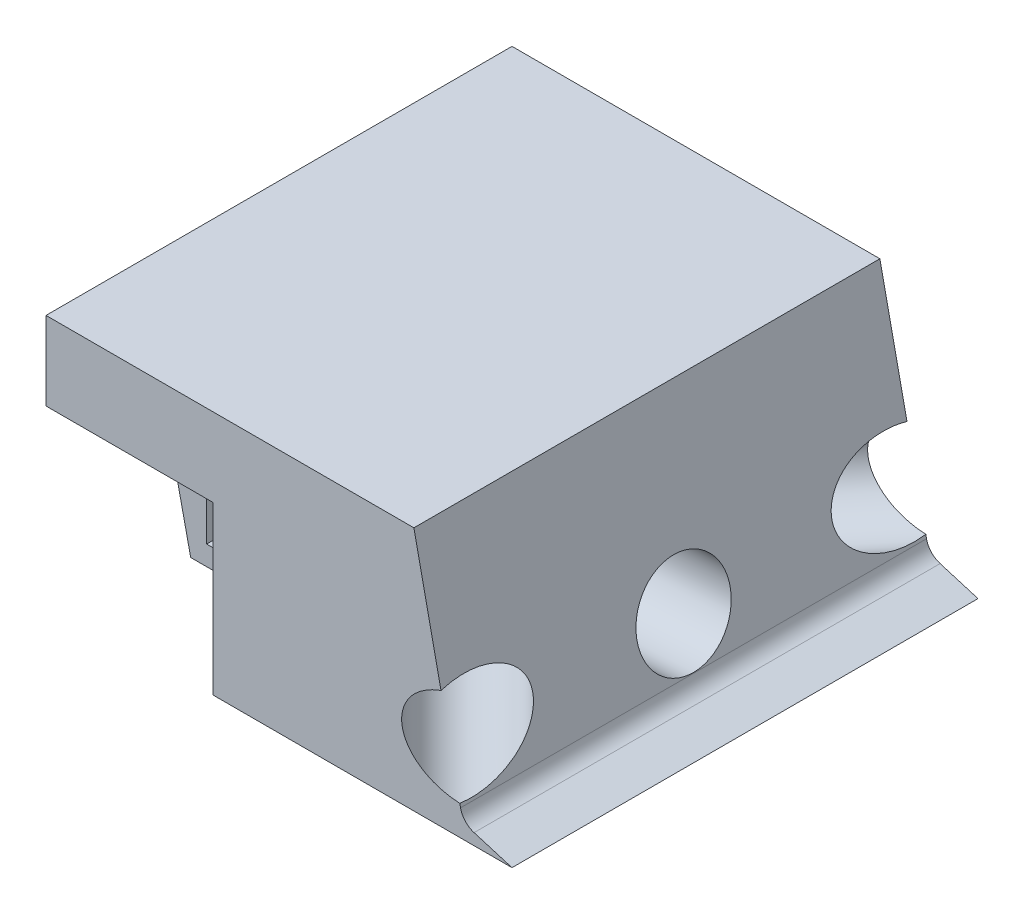
ISO-10303-21;
HEADER;
FILE_DESCRIPTION(('STEP AP214'),'2;1');
FILE_NAME('part.step','',(''),(''),'','','');
FILE_SCHEMA(('AUTOMOTIVE_DESIGN { 1 0 10303 214 1 1 1 1 }'));
ENDSEC;
DATA;
#1=APPLICATION_CONTEXT('core data for automotive mechanical design processes');
#2=APPLICATION_PROTOCOL_DEFINITION('international standard','automotive_design',2000,#1);
#3=PRODUCT_CONTEXT('',#1,'mechanical');
#4=PRODUCT('Part','Part','',(#3));
#5=PRODUCT_RELATED_PRODUCT_CATEGORY('part','',(#4));
#6=PRODUCT_DEFINITION_FORMATION('','',#4);
#7=PRODUCT_DEFINITION_CONTEXT('part definition',#1,'design');
#8=PRODUCT_DEFINITION('design','',#6,#7);
#9=PRODUCT_DEFINITION_SHAPE('','',#8);
#10=(LENGTH_UNIT() NAMED_UNIT(*) SI_UNIT(.MILLI.,.METRE.));
#11=(NAMED_UNIT(*) PLANE_ANGLE_UNIT() SI_UNIT($,.RADIAN.));
#12=(NAMED_UNIT(*) SI_UNIT($,.STERADIAN.) SOLID_ANGLE_UNIT());
#13=UNCERTAINTY_MEASURE_WITH_UNIT(LENGTH_MEASURE(1.E-05),#10,'distance_accuracy_value','');
#14=(GEOMETRIC_REPRESENTATION_CONTEXT(3) GLOBAL_UNCERTAINTY_ASSIGNED_CONTEXT((#13)) GLOBAL_UNIT_ASSIGNED_CONTEXT((#10,
#11,#12)) REPRESENTATION_CONTEXT('',''));
#15=CARTESIAN_POINT('',(0.,0.,0.));
#16=DIRECTION('',(0.,0.,1.));
#17=DIRECTION('',(1.,0.,0.));
#18=AXIS2_PLACEMENT_3D('',#15,#16,#17);
#19=CARTESIAN_POINT('',(29.0534494855228,3.,-54.5438018836308));
#20=DIRECTION('',(-0.978105928984835,-0.208107644464859,0.));
#21=DIRECTION('',(0.208107644464859,-0.978105928984836,0.));
#22=AXIS2_PLACEMENT_3D('',#19,#20,#21);
#23=PLANE('',#22);
#24=CARTESIAN_POINT('',(26.5329230763294,14.8464741232089,-2.04380188363075));
#25=DIRECTION('',(-0.978105928984835,-0.208107644464859,0.));
#26=DIRECTION('',(-0.208107644464859,0.978105928984836,0.));
#27=AXIS2_PLACEMENT_3D('',#24,#25,#26);
#28=ELLIPSE('',#27,9.61631485144088,9.5);
#29=CARTESIAN_POINT('',(24.5316944441636,24.2522486943882,-2.04380188363075));
#30=VERTEX_POINT('',#29);
#31=EDGE_CURVE('E230',#30,#30,#28,.F.);
#32=ORIENTED_EDGE('',*,*,#31,.F.);
#33=EDGE_LOOP('',(#32));
#34=FACE_BOUND('',#33,.T.);
#35=DIRECTION('',(0.208107644464859,-0.978105928984835,0.));
#36=VECTOR('',#35,1.);
#37=CARTESIAN_POINT('',(29.0534494855228,3.,45.4561981163693));
#38=LINE('',#37,#36);
#39=CARTESIAN_POINT('',(28.4070974389529,6.03785461887886,45.4561981163693));
#40=VERTEX_POINT('',#39);
#41=CARTESIAN_POINT('',(28.5602756421312,5.31791706394046,45.4561981163693));
#42=VERTEX_POINT('',#41);
#43=EDGE_CURVE('E233',#40,#42,#38,.T.);
#44=ORIENTED_EDGE('',*,*,#43,.T.);
#45=DIRECTION('',(0.,0.,1.));
#46=VECTOR('',#45,1.);
#47=CARTESIAN_POINT('',(28.5602756421312,5.31791706394046,-49.5438018836307));
#48=LINE('',#47,#46);
#49=CARTESIAN_POINT('',(28.5602756421313,5.31791706394044,-49.5438018836307));
#50=VERTEX_POINT('',#49);
#51=EDGE_CURVE('E332',#42,#50,#48,.F.);
#52=ORIENTED_EDGE('',*,*,#51,.T.);
#53=DIRECTION('',(0.208107644464859,-0.978105928984836,0.));
#54=VECTOR('',#53,1.);
#55=CARTESIAN_POINT('',(15.8052901091694,65.266349068861,-49.5438018836307));
#56=LINE('',#55,#54);
#57=CARTESIAN_POINT('',(28.4070974389529,6.03785461887894,-49.5438018836307));
#58=VERTEX_POINT('',#57);
#59=EDGE_CURVE('E242',#58,#50,#56,.T.);
#60=ORIENTED_EDGE('',*,*,#59,.F.);
#61=CARTESIAN_POINT('',(26.4460534707917,15.2547612692362,-45.9972058727721));
#62=DIRECTION('',(-0.978105928984835,-0.208107644464859,0.));
#63=DIRECTION('',(-0.0258354710819737,0.121426714085276,0.992264118841564));
#64=AXIS2_PLACEMENT_3D('',#61,#62,#63);
#65=ELLIPSE('',#64,13.5164397497986,9.49999999999975);
#66=CARTESIAN_POINT('',(24.5777437795974,24.0358168178494,-49.5438018836307));
#67=VERTEX_POINT('',#66);
#68=EDGE_CURVE('E223',#67,#58,#65,.F.);
#69=ORIENTED_EDGE('',*,*,#68,.F.);
#70=CARTESIAN_POINT('',(19.0534494855228,50.,-49.5438018836307));
#71=VERTEX_POINT('',#70);
#72=EDGE_CURVE('E243',#71,#67,#56,.T.);
#73=ORIENTED_EDGE('',*,*,#72,.F.);
#74=DIRECTION('',(0.,0.,1.));
#75=VECTOR('',#74,1.);
#76=CARTESIAN_POINT('',(19.0534494855228,50.,-54.5438018836308));
#77=LINE('',#76,#75);
#78=CARTESIAN_POINT('',(19.0534494855228,50.,45.4561981163693));
#79=VERTEX_POINT('',#78);
#80=EDGE_CURVE('E240',#71,#79,#77,.T.);
#81=ORIENTED_EDGE('',*,*,#80,.T.);
#82=CARTESIAN_POINT('',(24.5777437795974,24.0358168178494,45.4561981163693));
#83=VERTEX_POINT('',#82);
#84=EDGE_CURVE('E234',#79,#83,#38,.T.);
#85=ORIENTED_EDGE('',*,*,#84,.T.);
#86=CARTESIAN_POINT('',(26.4460534707917,15.2547612692361,41.9096021055104));
#87=DIRECTION('',(-0.978105928984835,-0.208107644464859,0.));
#88=DIRECTION('',(-0.0258354710819744,0.12142671408528,-0.992264118841563));
#89=AXIS2_PLACEMENT_3D('',#86,#87,#88);
#90=ELLIPSE('',#89,13.5164397497986,9.49999999999983);
#91=EDGE_CURVE('E228',#40,#83,#90,.F.);
#92=ORIENTED_EDGE('',*,*,#91,.F.);
#93=EDGE_LOOP('',(#44,#52,#60,#69,#73,#81,#85,#92));
#94=FACE_BOUND('',#93,.T.);
#95=ADVANCED_FACE('F33',(#34,#94),#23,.F.);
#96=CARTESIAN_POINT('',(-55.9465505144772,50.,-49.5438018836307));
#97=DIRECTION('',(0.,0.,1.));
#98=DIRECTION('',(1.,0.,0.));
#99=AXIS2_PLACEMENT_3D('',#96,#97,#98);
#100=PLANE('',#99);
#101=DIRECTION('',(-1.,0.,0.));
#102=VECTOR('',#101,1.);
#103=CARTESIAN_POINT('',(-55.9465505144772,0.,-49.5438018836307));
#104=LINE('',#103,#102);
#105=CARTESIAN_POINT('',(39.0534494855228,0.,-49.5438018836307));
#106=VERTEX_POINT('',#105);
#107=CARTESIAN_POINT('',(-21.9465505144772,0.,-49.5438018836307));
#108=VERTEX_POINT('',#107);
#109=EDGE_CURVE('E302',#106,#108,#104,.T.);
#110=ORIENTED_EDGE('',*,*,#109,.T.);
#111=DIRECTION('',(0.,-1.,0.));
#112=VECTOR('',#111,1.);
#113=CARTESIAN_POINT('',(-21.9465505144772,0.,-49.5438018836307));
#114=LINE('',#113,#112);
#115=CARTESIAN_POINT('',(-21.9465505144772,34.,-49.5438018836307));
#116=VERTEX_POINT('',#115);
#117=EDGE_CURVE('E376',#116,#108,#114,.T.);
#118=ORIENTED_EDGE('',*,*,#117,.F.);
#119=DIRECTION('',(1.,0.,0.));
#120=VECTOR('',#119,1.);
#121=CARTESIAN_POINT('',(-55.9465505144772,34.,-49.5438018836307));
#122=LINE('',#121,#120);
#123=CARTESIAN_POINT('',(-55.9465505144772,34.,-49.5438018836307));
#124=VERTEX_POINT('',#123);
#125=EDGE_CURVE('E357',#124,#116,#122,.T.);
#126=ORIENTED_EDGE('',*,*,#125,.F.);
#127=DIRECTION('',(0.,-1.,0.));
#128=VECTOR('',#127,1.);
#129=CARTESIAN_POINT('',(-55.9465505144772,50.,-49.5438018836307));
#130=LINE('',#129,#128);
#131=CARTESIAN_POINT('',(-55.9465505144772,50.,-49.5438018836307));
#132=VERTEX_POINT('',#131);
#133=EDGE_CURVE('E307',#132,#124,#130,.T.);
#134=ORIENTED_EDGE('',*,*,#133,.F.);
#135=DIRECTION('',(-1.,0.,0.));
#136=VECTOR('',#135,1.);
#137=CARTESIAN_POINT('',(-55.9465505144772,50.,-49.5438018836307));
#138=LINE('',#137,#136);
#139=EDGE_CURVE('E305',#71,#132,#138,.T.);
#140=ORIENTED_EDGE('',*,*,#139,.F.);
#141=ORIENTED_EDGE('',*,*,#72,.T.);
#142=CARTESIAN_POINT('',(29.9926494816504,15.555699919965,-49.5438018836307));
#143=DIRECTION('',(0.,0.,1.));
#144=DIRECTION('',(-0.996419324090102,-0.0845489833163317,0.));
#145=AXIS2_PLACEMENT_3D('',#142,#143,#144);
#146=ELLIPSE('',#145,13.4591901688025,9.49999999999975);
#147=EDGE_CURVE('E327',#58,#67,#146,.F.);
#148=ORIENTED_EDGE('',*,*,#147,.F.);
#149=ORIENTED_EDGE('',*,*,#59,.T.);
#150=CARTESIAN_POINT('',(32.4726993580706,6.1503476417999,-49.5438018836307));
#151=DIRECTION('',(0.,0.,1.));
#152=DIRECTION('',(1.,0.,0.));
#153=AXIS2_PLACEMENT_3D('',#150,#151,#152);
#154=CIRCLE('',#153,4.);
#155=CARTESIAN_POINT('',(31.3233078158052,2.31904250091529,-49.5438018836307));
#156=VERTEX_POINT('',#155);
#157=EDGE_CURVE('E336',#50,#156,#154,.T.);
#158=ORIENTED_EDGE('',*,*,#157,.T.);
#159=DIRECTION('',(0.957826285221151,-0.287347885566345,0.));
#160=VECTOR('',#159,1.);
#161=CARTESIAN_POINT('',(-61.8639817071377,30.2752293577982,-49.5438018836307));
#162=LINE('',#161,#160);
#163=EDGE_CURVE('E246',#156,#106,#162,.T.);
#164=ORIENTED_EDGE('',*,*,#163,.T.);
#165=EDGE_LOOP('',(#110,#118,#126,#134,#140,#141,#148,#149,#158,#164));
#166=FACE_BOUND('',#165,.T.);
#167=ADVANCED_FACE('F396',(#166),#100,.F.);
#168=CARTESIAN_POINT('',(-55.9465505144772,50.,45.4561981163693));
#169=DIRECTION('',(0.,0.,-1.));
#170=DIRECTION('',(-1.,0.,0.));
#171=AXIS2_PLACEMENT_3D('',#168,#169,#170);
#172=PLANE('',#171);
#173=DIRECTION('',(0.,-1.,0.));
#174=VECTOR('',#173,1.);
#175=CARTESIAN_POINT('',(-55.9465505144772,50.,45.4561981163693));
#176=LINE('',#175,#174);
#177=CARTESIAN_POINT('',(-55.9465505144772,50.,45.4561981163693));
#178=VERTEX_POINT('',#177);
#179=CARTESIAN_POINT('',(-55.9465505144772,34.,45.4561981163693));
#180=VERTEX_POINT('',#179);
#181=EDGE_CURVE('E316',#178,#180,#176,.T.);
#182=ORIENTED_EDGE('',*,*,#181,.T.);
#183=DIRECTION('',(-1.,0.,0.));
#184=VECTOR('',#183,1.);
#185=CARTESIAN_POINT('',(-55.9465505144772,34.,45.4561981163693));
#186=LINE('',#185,#184);
#187=CARTESIAN_POINT('',(-21.9465505144772,34.,45.4561981163693));
#188=VERTEX_POINT('',#187);
#189=EDGE_CURVE('E207',#188,#180,#186,.T.);
#190=ORIENTED_EDGE('',*,*,#189,.F.);
#191=DIRECTION('',(0.,1.,0.));
#192=VECTOR('',#191,1.);
#193=CARTESIAN_POINT('',(-21.9465505144772,0.,45.4561981163693));
#194=LINE('',#193,#192);
#195=CARTESIAN_POINT('',(-21.9465505144772,0.,45.4561981163693));
#196=VERTEX_POINT('',#195);
#197=EDGE_CURVE('E210',#196,#188,#194,.T.);
#198=ORIENTED_EDGE('',*,*,#197,.F.);
#199=DIRECTION('',(1.,0.,0.));
#200=VECTOR('',#199,1.);
#201=CARTESIAN_POINT('',(-55.9465505144772,0.,45.4561981163693));
#202=LINE('',#201,#200);
#203=CARTESIAN_POINT('',(39.0534494855228,0.,45.4561981163693));
#204=VERTEX_POINT('',#203);
#205=EDGE_CURVE('E296',#196,#204,#202,.T.);
#206=ORIENTED_EDGE('',*,*,#205,.T.);
#207=DIRECTION('',(0.957826285221151,-0.287347885566345,0.));
#208=VECTOR('',#207,1.);
#209=CARTESIAN_POINT('',(39.0534494855228,0.,45.4561981163693));
#210=LINE('',#209,#208);
#211=CARTESIAN_POINT('',(31.3233078158052,2.31904250091529,45.4561981163693));
#212=VERTEX_POINT('',#211);
#213=EDGE_CURVE('E237',#212,#204,#210,.T.);
#214=ORIENTED_EDGE('',*,*,#213,.F.);
#215=CARTESIAN_POINT('',(32.4726993580706,6.1503476417999,45.4561981163693));
#216=DIRECTION('',(0.,0.,-1.));
#217=DIRECTION('',(-1.,0.,0.));
#218=AXIS2_PLACEMENT_3D('',#215,#216,#217);
#219=CIRCLE('',#218,4.);
#220=EDGE_CURVE('E334',#212,#42,#219,.T.);
#221=ORIENTED_EDGE('',*,*,#220,.T.);
#222=ORIENTED_EDGE('',*,*,#43,.F.);
#223=CARTESIAN_POINT('',(29.9926494816506,15.555699919965,45.4561981163693));
#224=DIRECTION('',(0.,0.,-1.));
#225=DIRECTION('',(-0.996419324090102,-0.0845489833163307,0.));
#226=AXIS2_PLACEMENT_3D('',#223,#224,#225);
#227=ELLIPSE('',#226,13.4591901688027,9.49999999999983);
#228=EDGE_CURVE('E325',#83,#40,#227,.F.);
#229=ORIENTED_EDGE('',*,*,#228,.F.);
#230=ORIENTED_EDGE('',*,*,#84,.F.);
#231=DIRECTION('',(1.,0.,0.));
#232=VECTOR('',#231,1.);
#233=CARTESIAN_POINT('',(-55.9465505144772,50.,45.4561981163693));
#234=LINE('',#233,#232);
#235=EDGE_CURVE('E301',#178,#79,#234,.T.);
#236=ORIENTED_EDGE('',*,*,#235,.F.);
#237=EDGE_LOOP('',(#182,#190,#198,#206,#214,#221,#222,#229,#230,#236));
#238=FACE_BOUND('',#237,.T.);
#239=ADVANCED_FACE('F422',(#238),#172,.F.);
#240=CARTESIAN_POINT('',(-6.71686597218381,13.0509855145892,-2.04380188363075));
#241=DIRECTION('',(0.998545180917308,0.0539214397695347,0.));
#242=DIRECTION('',(-0.0539214397695347,0.998545180917309,0.));
#243=AXIS2_PLACEMENT_3D('',#240,#241,#242);
#244=CYLINDRICAL_SURFACE('',#243,9.5);
#245=CARTESIAN_POINT('',(2.07595286425523,13.5257977317569,-2.04380188363075));
#246=DIRECTION('',(0.705837415242126,0.0598922907279467,0.705837415242118));
#247=DIRECTION('',(0.706320591921478,0.0163066443508853,-0.707704256577355));
#248=AXIS2_PLACEMENT_3D('',#245,#246,#247);
#249=ELLIPSE('',#248,13.4173205237938,9.5);
#250=CARTESIAN_POINT('',(-2.73529182406759,5.50305391920782,3.44819519112124));
#251=VERTEX_POINT('',#250);
#252=CARTESIAN_POINT('',(-6.54250412568018,9.82206243118863,6.88892746791498));
#253=VERTEX_POINT('',#252);
#254=EDGE_CURVE('E643',#251,#253,#249,.F.);
#255=ORIENTED_EDGE('',*,*,#254,.F.);
#256=CARTESIAN_POINT('',(-2.7352918240672,5.50305391920813,3.44819519112081));
#257=CARTESIAN_POINT('',(-2.5284890396485,5.58685697103673,3.5505474548381));
#258=CARTESIAN_POINT('',(-2.3222355963858,5.67306030095207,3.65206497166396));
#259=CARTESIAN_POINT('',(-1.91110718577176,5.85059238639249,3.85347303838734));
#260=CARTESIAN_POINT('',(-1.70623240708124,5.94192182803639,3.95336336816974));
#261=CARTESIAN_POINT('',(-1.29763031305163,6.13026980249333,4.15180725024607));
#262=CARTESIAN_POINT('',(-1.09390776310995,6.22730342723031,4.25035632084846));
#263=CARTESIAN_POINT('',(-0.688557696195556,6.42721184050974,4.44581016289113));
#264=CARTESIAN_POINT('',(-0.486930093797941,6.53008638976437,4.54271500148048));
#265=CARTESIAN_POINT('',(-0.0847881839953783,6.74287105630762,4.73549621581496));
#266=CARTESIAN_POINT('',(0.115708565043817,6.85282521869078,4.83136071335836));
#267=CARTESIAN_POINT('',(0.513627162757627,7.07965853107784,5.02125567522945));
#268=CARTESIAN_POINT('',(0.711049141472897,7.19653738720717,5.11528621716293));
#269=CARTESIAN_POINT('',(1.10197559395353,7.43774076208653,5.301251481034));
#270=CARTESIAN_POINT('',(1.29548399963161,7.56205725451272,5.39318831952808));
#271=CARTESIAN_POINT('',(1.67796518608724,7.8189913108621,5.57481606934673));
#272=CARTESIAN_POINT('',(1.86693869036715,7.95160753829248,5.66450733903164));
#273=CARTESIAN_POINT('',(2.20745427281438,8.20256786234128,5.82618031272111));
#274=CARTESIAN_POINT('',(2.35986663423278,8.31946927462305,5.89856544179133));
#275=CARTESIAN_POINT('',(2.66012156386082,8.56021596723413,6.04130759747589));
#276=CARTESIAN_POINT('',(2.80796392173639,8.68406156643315,6.11166453073266));
#277=CARTESIAN_POINT('',(3.09835826000453,8.93960229109413,6.25012111359561));
#278=CARTESIAN_POINT('',(3.2409005475566,9.07131075085102,6.318216605284));
#279=CARTESIAN_POINT('',(3.51915176008551,9.34313632387322,6.45155056223067));
#280=CARTESIAN_POINT('',(3.65486093357087,9.48325313093473,6.516789131379));
#281=CARTESIAN_POINT('',(3.91977000202753,9.77491405274352,6.64473796275492));
#282=CARTESIAN_POINT('',(4.04884565410897,9.92659533462317,6.70739728705121));
#283=CARTESIAN_POINT('',(4.29597800501789,10.2402898625221,6.82824748125247));
#284=CARTESIAN_POINT('',(4.41403093095531,10.4023066144884,6.88643681995864));
#285=CARTESIAN_POINT('',(4.7463903980432,10.9039127852696,7.05214090146896));
#286=CARTESIAN_POINT('',(4.94067101181784,11.2609089942035,7.15164171155111));
#287=CARTESIAN_POINT('',(5.17078091057172,11.8421317495828,7.27690912252399));
#288=CARTESIAN_POINT('',(5.23830109718238,12.0510792622815,7.3154639919302));
#289=CARTESIAN_POINT('',(5.3416578257548,12.4786785073256,7.37971805671404));
#290=CARTESIAN_POINT('',(5.37752719413414,12.6973199378516,7.40543055941598));
#291=CARTESIAN_POINT('',(5.41279066674086,13.1404562507173,7.44198829889074));
#292=CARTESIAN_POINT('',(5.41193054665659,13.3649811764726,7.45272938262297));
#293=CARTESIAN_POINT('',(5.37165861093977,13.8107714853821,7.45823060667445));
#294=CARTESIAN_POINT('',(5.33224104227713,14.0320363771165,7.45298836192672));
#295=CARTESIAN_POINT('',(5.22262018502946,14.4469965972219,7.42868963074717));
#296=CARTESIAN_POINT('',(5.15510100921995,14.6414877960957,7.41075957375059));
#297=CARTESIAN_POINT('',(4.99485974943007,15.018267243802,7.36422678667008));
#298=CARTESIAN_POINT('',(4.90212785115159,15.2005507061451,7.33561989890603));
#299=CARTESIAN_POINT('',(4.63169114317075,15.6622771543008,7.24907779602607));
#300=CARTESIAN_POINT('',(4.4372549121772,15.9305980440984,7.18401901245872));
#301=CARTESIAN_POINT('',(4.11936110556804,16.3069410784372,7.07519806911159));
#302=CARTESIAN_POINT('',(4.00878729010553,16.4282384797407,7.03696863458578));
#303=CARTESIAN_POINT('',(3.78040187587814,16.6627627907887,6.95742701935154));
#304=CARTESIAN_POINT('',(3.6625916221266,16.7759911918916,6.91611541121222));
#305=CARTESIAN_POINT('',(3.31917347868404,17.087419109953,6.79508959636809));
#306=CARTESIAN_POINT('',(3.08651224274498,17.2766689869357,6.71239387906013));
#307=CARTESIAN_POINT('',(2.607150474039,17.6336336212181,6.54122849014518));
#308=CARTESIAN_POINT('',(2.36043720803621,17.801328383506,6.4527535707085));
#309=CARTESIAN_POINT('',(1.85561772598296,18.119053854895,6.27138163992721));
#310=CARTESIAN_POINT('',(1.59745980077808,18.2689900672961,6.17846436837508));
#311=CARTESIAN_POINT('',(1.07360789387455,18.5527683466452,5.98991773858171));
#312=CARTESIAN_POINT('',(0.80791664029042,18.6866161501171,5.8942893621396));
#313=CARTESIAN_POINT('',(0.333484370093445,18.9106789829904,5.72377565958062));
#314=CARTESIAN_POINT('',(0.125956301414573,19.0037776166849,5.6492695208411));
#315=CARTESIAN_POINT('',(-0.292009575162518,19.1825415844987,5.4994889075905));
#316=CARTESIAN_POINT('',(-0.502447589724232,19.2682063874935,5.42421437860899));
#317=CARTESIAN_POINT('',(-1.13771541662509,19.5151487420168,5.19755551081745));
#318=CARTESIAN_POINT('',(-1.5662620281544,19.6662643995045,5.04542132505742));
#319=CARTESIAN_POINT('',(-2.20957714194902,19.8739760297287,4.81889076944873));
#320=CARTESIAN_POINT('',(-2.4215960450027,19.9393886465901,4.74452621582118));
#321=CARTESIAN_POINT('',(-2.84722869456327,20.0650462834311,4.59594933018217));
#322=CARTESIAN_POINT('',(-3.06084247655929,20.1252911880445,4.52173700160513));
#323=CARTESIAN_POINT('',(-3.48911661576973,20.2408267523935,4.37379168444273));
#324=CARTESIAN_POINT('',(-3.70377447327178,20.2961259345674,4.30005808257861));
#325=CARTESIAN_POINT('',(-4.1343860358446,20.4021413520917,4.15314214013571));
#326=CARTESIAN_POINT('',(-4.35033962957167,20.4528579753771,4.07995975337569));
#327=CARTESIAN_POINT('',(-4.56689805842534,20.5014142819928,4.00714834717474));
#328=B_SPLINE_CURVE_WITH_KNOTS('',3,(#256,#257,#258,#259,#260,#261,#262,#263,#264,#265,#266,
#267,#268,#269,#270,#271,#272,#273,#274,#275,#276,#277,#278,#279,#280,#281,#282,#283,#284,#285,
#286,#287,#288,#289,#290,#291,#292,#293,#294,#295,#296,#297,#298,#299,#300,#301,#302,#303,#304,
#305,#306,#307,#308,#309,#310,#311,#312,#313,#314,#315,#316,#317,#318,#319,#320,#321,#322,#323,
#324,#325,#326,#327),.UNSPECIFIED.,.F.,.F.,(4,2,2,2,2,2,2,2,2,2,2,2,2,2,2,2,2,2,2,2,2,2,2,2,2,2,
2,2,2,2,2,2,2,2,2,4),(0.,0.736474954782578,1.47304872129461,2.21166761566259,2.95025627249742,
3.69399354147617,4.43769926983485,5.18061641913616,5.92341424398032,6.53906498553613,
7.15474402030964,7.77149857583298,8.3882306848381,9.01398354687215,9.63994981417915,
10.8838580104374,11.550440569303,12.2163309715297,12.8868310973119,13.5574312814754,
14.1749447147176,14.7926988660801,15.7995648840619,16.3049281886689,16.8101978456077,
17.7419560001177,18.6745723310167,19.611947329555,20.5489870975344,21.2668831880064,
21.9848305278057,23.4215482412065,24.1235416579923,24.8255507423223,25.5263258328982,
26.2270415439241),.UNSPECIFIED.);
#329=CARTESIAN_POINT('',(-4.5668980584258,20.5014142819928,4.00714834717488));
#330=VERTEX_POINT('',#329);
#331=EDGE_CURVE('E251',#251,#330,#328,.T.);
#332=ORIENTED_EDGE('',*,*,#331,.T.);
#333=CARTESIAN_POINT('',(-6.92054724762188,16.8228609856645,6.67293313406577));
#334=VERTEX_POINT('',#333);
#335=EDGE_CURVE('E259',#334,#330,#249,.F.);
#336=ORIENTED_EDGE('',*,*,#335,.F.);
#337=CARTESIAN_POINT('',(-6.71686597218381,13.0509855145892,-2.04380188363075));
#338=DIRECTION('',(0.998545180917308,0.0539214397695347,0.));
#339=DIRECTION('',(-0.0539214397695347,0.998545180917309,0.));
#340=AXIS2_PLACEMENT_3D('',#337,#338,#339);
#341=CIRCLE('',#340,9.5);
#342=CARTESIAN_POINT('',(-6.92054724762186,16.8228609856642,-10.7605369013274));
#343=VERTEX_POINT('',#342);
#344=EDGE_CURVE('E293',#343,#334,#341,.T.);
#345=ORIENTED_EDGE('',*,*,#344,.F.);
#346=CARTESIAN_POINT('',(2.07595286425553,13.525797731757,-2.04380188363075));
#347=DIRECTION('',(0.705837415242118,0.0598922907279468,-0.705837415242125));
#348=DIRECTION('',(0.706320591921486,0.0163066443508857,0.707704256577347));
#349=AXIS2_PLACEMENT_3D('',#346,#347,#348);
#350=ELLIPSE('',#349,13.4173205237939,9.5);
#351=CARTESIAN_POINT('',(-4.56689805842566,20.5014142819929,-8.09475211443639));
#352=VERTEX_POINT('',#351);
#353=EDGE_CURVE('E292',#352,#343,#350,.F.);
#354=ORIENTED_EDGE('',*,*,#353,.F.);
#355=CARTESIAN_POINT('',(-4.56689805842484,20.5014142819925,-8.0947521144356));
#356=CARTESIAN_POINT('',(-4.33225599602943,20.4488003755294,-8.17364472122514));
#357=CARTESIAN_POINT('',(-4.09831991987234,20.3936533999042,-8.25297274054923));
#358=CARTESIAN_POINT('',(-3.6319723273335,20.2779532455273,-8.41225867708304));
#359=CARTESIAN_POINT('',(-3.39956099855203,20.2173994144437,-8.49221666923444));
#360=CARTESIAN_POINT('',(-2.935850455229,20.0903986941744,-8.65270379654423));
#361=CARTESIAN_POINT('',(-2.70455550191642,20.0239373811584,-8.73323386194536));
#362=CARTESIAN_POINT('',(-2.24388052249788,19.8848391065148,-8.89442045986951));
#363=CARTESIAN_POINT('',(-2.01450042627539,19.8122023721123,-8.97507698763224));
#364=CARTESIAN_POINT('',(-1.55665311912561,19.6598445083659,-9.13671461530698));
#365=CARTESIAN_POINT('',(-1.32819788787797,19.5800865754283,-9.21769505721916));
#366=CARTESIAN_POINT('',(-0.873840453641928,19.4132426691012,-9.37926210189281));
#367=CARTESIAN_POINT('',(-0.647938153388363,19.3261569759698,-9.45984871959191));
#368=CARTESIAN_POINT('',(-0.199351831332736,19.144036344205,-9.6202507628795));
#369=CARTESIAN_POINT('',(0.023335063029552,19.0490090914755,-9.70006685259626));
#370=CARTESIAN_POINT('',(0.465080976334485,18.850102721621,-9.85864143280677));
#371=CARTESIAN_POINT('',(0.684140511012849,18.746224876001,-9.93740007334148));
#372=CARTESIAN_POINT('',(1.0882753148595,18.5434306951372,-10.0827938815438));
#373=CARTESIAN_POINT('',(1.27391125425415,18.4457695180671,-10.1496176838629));
#374=CARTESIAN_POINT('',(1.64121856569114,18.2422888667174,-10.2818141032291));
#375=CARTESIAN_POINT('',(1.8228897567433,18.1364690209913,-10.3471866540291));
#376=CARTESIAN_POINT('',(2.18180318740148,17.9154812272708,-10.4761990874294));
#377=CARTESIAN_POINT('',(2.35903321530376,17.8002905639837,-10.5398342282835));
#378=CARTESIAN_POINT('',(2.70736810734731,17.5597145325413,-10.6646267749547));
#379=CARTESIAN_POINT('',(2.87847325864263,17.4343296432282,-10.7257842969483));
#380=CARTESIAN_POINT('',(3.21560789538356,17.1700108716297,-10.8458280804137));
#381=CARTESIAN_POINT('',(3.3815120071856,17.0308919788594,-10.9046622011023));
#382=CARTESIAN_POINT('',(3.70301721095151,16.7393269509347,-11.0179659926317));
#383=CARTESIAN_POINT('',(3.85861388019386,16.5868751591608,-11.0724337920489));
#384=CARTESIAN_POINT('',(4.15532843354882,16.2681178542739,-11.175255156819));
#385=CARTESIAN_POINT('',(4.29652253014544,16.1018947160832,-11.2236412584394));
#386=CARTESIAN_POINT('',(4.56092453322871,15.7538739756097,-11.312729991647));
#387=CARTESIAN_POINT('',(4.6841501476811,15.5720919909097,-11.3534401995967));
#388=CARTESIAN_POINT('',(4.90699547178048,15.1928383248048,-11.4248090153655));
#389=CARTESIAN_POINT('',(5.00664714506123,14.9953883784836,-11.4554812554512));
#390=CARTESIAN_POINT('',(5.17599854601488,14.5865103891999,-11.504156845132));
#391=CARTESIAN_POINT('',(5.24572689940183,14.3750959296611,-11.5221723132073));
#392=CARTESIAN_POINT('',(5.34995577599859,13.9412413877521,-11.543365030161));
#393=CARTESIAN_POINT('',(5.38420212979633,13.71873356199,-11.5464357958064));
#394=CARTESIAN_POINT('',(5.41393294135975,13.2714775021975,-11.5365326069259));
#395=CARTESIAN_POINT('',(5.4094138866725,13.0467290669929,-11.5235571985806));
#396=CARTESIAN_POINT('',(5.3655597958662,12.6205480738891,-11.4842653281633));
#397=CARTESIAN_POINT('',(5.32906057848457,12.4186964095706,-11.4591085752597));
#398=CARTESIAN_POINT('',(5.22927541660934,12.0235933932393,-11.3979350687655));
#399=CARTESIAN_POINT('',(5.16597845962318,11.830345613103,-11.3619138521912));
#400=CARTESIAN_POINT('',(4.97172264577934,11.3387911087939,-11.2561248609913));
#401=CARTESIAN_POINT('',(4.82309423269255,11.0489905434561,-11.1792291698687));
#402=CARTESIAN_POINT('',(4.5709731233482,10.6363754584025,-11.0521685963663));
#403=CARTESIAN_POINT('',(4.48187362643259,10.5022858197283,-11.0077672229066));
#404=CARTESIAN_POINT('',(4.29553006882358,10.2410530940272,-10.9156780870717));
#405=CARTESIAN_POINT('',(4.19828744896855,10.1139087846493,-10.8679909063485));
#406=CARTESIAN_POINT('',(3.91295820390433,9.76255830121186,-10.7288676210697));
#407=CARTESIAN_POINT('',(3.71691217857024,9.54610723217295,-10.6341976878373));
#408=CARTESIAN_POINT('',(3.30856784086871,9.13237785709488,-10.4381006952109));
#409=CARTESIAN_POINT('',(3.09625481624534,8.93511728218306,-10.3366675300084));
#410=CARTESIAN_POINT('',(2.65870269186332,8.55646590935589,-10.1281800605755));
#411=CARTESIAN_POINT('',(2.43340888811384,8.37515186222596,-10.021102157976));
#412=CARTESIAN_POINT('',(1.97367945489025,8.02718286624318,-9.80277028206226));
#413=CARTESIAN_POINT('',(1.73924105454741,7.86053241113764,-9.69151504337773));
#414=CARTESIAN_POINT('',(1.16336505936575,7.47279453375139,-9.41805676499994));
#415=CARTESIAN_POINT('',(0.818360817173119,7.25825792323411,-9.25408961908723));
#416=CARTESIAN_POINT('',(0.118215035644663,6.8511184717841,-8.92028491578519));
#417=CARTESIAN_POINT('',(-0.236932595157035,6.658529172737,-8.7504438173944));
#418=CARTESIAN_POINT('',(-0.946922814297158,6.29630927652942,-8.40912523956741));
#419=CARTESIAN_POINT('',(-1.30161631569162,6.12628262905609,-8.23775634720461));
#420=CARTESIAN_POINT('',(-1.83709095063916,5.88358396276574,-7.97715602075883));
#421=CARTESIAN_POINT('',(-2.01602683832496,5.8047927816907,-7.88976128493358));
#422=CARTESIAN_POINT('',(-2.37492982051103,5.65107606405432,-7.71372460314205));
#423=CARTESIAN_POINT('',(-2.55489685977932,5.57615032255826,-7.6250827236136));
#424=CARTESIAN_POINT('',(-2.73529182406675,5.50305391920793,-7.53579895838253));
#425=B_SPLINE_CURVE_WITH_KNOTS('',3,(#355,#356,#357,#358,#359,#360,#361,#362,#363,#364,#365,
#366,#367,#368,#369,#370,#371,#372,#373,#374,#375,#376,#377,#378,#379,#380,#381,#382,#383,#384,
#385,#386,#387,#388,#389,#390,#391,#392,#393,#394,#395,#396,#397,#398,#399,#400,#401,#402,#403,
#404,#405,#406,#407,#408,#409,#410,#411,#412,#413,#414,#415,#416,#417,#418,#419,#420,#421,#422,
#423,#424),.UNSPECIFIED.,.F.,.F.,(4,2,2,2,2,2,2,2,2,2,2,2,2,2,2,2,2,2,2,2,2,2,2,2,2,2,2,2,2,2,2,
2,2,2,4),(0.,0.759235565759512,1.51856285664431,2.27979792708037,3.04100499993291,
3.80640315451802,4.57177204890092,5.33640860609208,6.10093549774817,6.76120496214763,
7.42150450496608,8.08345527666092,8.74537497320384,9.41790796150104,10.0907276759899,
10.7597790295933,11.4281665100883,12.0956424697516,12.7624784669635,13.434058883109,
14.1057001504001,14.7232015907741,15.3409570391736,16.338754396032,16.8395483653825,
17.340253911079,18.2597146907051,19.1800170979018,20.1045308137893,21.0293268728913,
22.3427231125527,23.6569254030598,24.9436310287062,25.5860736801143,26.2284822359456),.UNSPECIFIED.);
#426=CARTESIAN_POINT('',(-2.73529182406738,5.50305391920772,-7.53579895838272));
#427=VERTEX_POINT('',#426);
#428=EDGE_CURVE('E283',#352,#427,#425,.T.);
#429=ORIENTED_EDGE('',*,*,#428,.T.);
#430=CARTESIAN_POINT('',(-6.5425041256802,9.82206243118891,-10.9765312351766));
#431=VERTEX_POINT('',#430);
#432=EDGE_CURVE('E289',#431,#427,#350,.F.);
#433=ORIENTED_EDGE('',*,*,#432,.F.);
#434=EDGE_CURVE('E297',#253,#431,#341,.T.);
#435=ORIENTED_EDGE('',*,*,#434,.F.);
#436=EDGE_LOOP('',(#255,#332,#336,#345,#354,#429,#433,#435));
#437=FACE_BOUND('',#436,.T.);
#438=ORIENTED_EDGE('',*,*,#31,.T.);
#439=EDGE_LOOP('',(#438));
#440=FACE_BOUND('',#439,.T.);
#441=ADVANCED_FACE('F261',(#437,#440),#244,.F.);
#442=CARTESIAN_POINT('',(-7.66624825135373,12.3602364848829,-11.8849041506263));
#443=DIRECTION('',(0.705837415242118,0.0598922907279468,-0.705837415242125));
#444=DIRECTION('',(-0.707106781186551,0.,-0.707106781186544));
#445=AXIS2_PLACEMENT_3D('',#442,#443,#444);
#446=CYLINDRICAL_SURFACE('',#445,9.50000000000001);
#447=CARTESIAN_POINT('',(-7.66624825135373,12.3602364848829,-11.8849041506263));
#448=DIRECTION('',(0.705837415242118,0.0598922907279468,-0.705837415242125));
#449=DIRECTION('',(-0.707106781186551,0.,-0.707106781186544));
#450=AXIS2_PLACEMENT_3D('',#447,#448,#449);
#451=CIRCLE('',#450,9.50000000000001);
#452=EDGE_CURVE('E290',#427,#352,#451,.T.);
#453=ORIENTED_EDGE('',*,*,#452,.F.);
#454=ORIENTED_EDGE('',*,*,#428,.F.);
#455=EDGE_LOOP('',(#453,#454));
#456=FACE_BOUND('',#455,.T.);
#457=ORIENTED_EDGE('',*,*,#68,.T.);
#458=ORIENTED_EDGE('',*,*,#147,.T.);
#459=EDGE_LOOP('',(#457,#458));
#460=FACE_BOUND('',#459,.T.);
#461=ADVANCED_FACE('F271',(#456,#460),#446,.F.);
#462=CARTESIAN_POINT('',(-7.66624825135406,12.3602364848828,7.79730038336499));
#463=DIRECTION('',(0.705837415242126,0.0598922907279467,0.705837415242118));
#464=DIRECTION('',(0.707106781186544,0.,-0.707106781186551));
#465=AXIS2_PLACEMENT_3D('',#462,#463,#464);
#466=CYLINDRICAL_SURFACE('',#465,9.5);
#467=CARTESIAN_POINT('',(-7.66624825135406,12.3602364848828,7.79730038336499));
#468=DIRECTION('',(0.705837415242126,0.0598922907279467,0.705837415242118));
#469=DIRECTION('',(0.707106781186544,0.,-0.707106781186551));
#470=AXIS2_PLACEMENT_3D('',#467,#468,#469);
#471=CIRCLE('',#470,9.5);
#472=EDGE_CURVE('E248',#330,#251,#471,.T.);
#473=ORIENTED_EDGE('',*,*,#472,.F.);
#474=ORIENTED_EDGE('',*,*,#331,.F.);
#475=EDGE_LOOP('',(#473,#474));
#476=FACE_BOUND('',#475,.T.);
#477=ORIENTED_EDGE('',*,*,#91,.T.);
#478=ORIENTED_EDGE('',*,*,#228,.T.);
#479=EDGE_LOOP('',(#477,#478));
#480=FACE_BOUND('',#479,.T.);
#481=ADVANCED_FACE('F265',(#476,#480),#466,.F.);
#482=CARTESIAN_POINT('',(-6.71686597218381,13.0509855145892,-2.04380188363075));
#483=DIRECTION('',(0.998545180917308,0.0539214397695347,0.));
#484=DIRECTION('',(-0.0539214397695347,0.998545180917309,0.));
#485=AXIS2_PLACEMENT_3D('',#482,#483,#484);
#486=PLANE('',#485);
#487=ORIENTED_EDGE('',*,*,#344,.T.);
#488=DIRECTION('',(0.0538958687842377,-0.998071644152549,0.030793318538595));
#489=VECTOR('',#488,1.);
#490=CARTESIAN_POINT('',(-6.73152568665103,13.3224617084265,6.78093030099038));
#491=LINE('',#490,#489);
#492=EDGE_CURVE('E322',#334,#253,#491,.T.);
#493=ORIENTED_EDGE('',*,*,#492,.T.);
#494=ORIENTED_EDGE('',*,*,#434,.T.);
#495=DIRECTION('',(-0.0538958687842377,0.998071644152549,0.0307933185385954));
#496=VECTOR('',#495,1.);
#497=CARTESIAN_POINT('',(-6.73152568665103,13.3224617084266,-10.868534068252));
#498=LINE('',#497,#496);
#499=EDGE_CURVE('E319',#431,#343,#498,.T.);
#500=ORIENTED_EDGE('',*,*,#499,.T.);
#501=EDGE_LOOP('',(#487,#493,#494,#500));
#502=FACE_BOUND('',#501,.T.);
#503=ADVANCED_FACE('F270',(#502),#486,.T.);
#504=CARTESIAN_POINT('',(-7.66624825135373,12.3602364848829,-11.8849041506263));
#505=DIRECTION('',(0.705837415242118,0.0598922907279468,-0.705837415242125));
#506=DIRECTION('',(-0.707106781186551,0.,-0.707106781186544));
#507=AXIS2_PLACEMENT_3D('',#504,#505,#506);
#508=PLANE('',#507);
#509=ORIENTED_EDGE('',*,*,#353,.T.);
#510=ORIENTED_EDGE('',*,*,#499,.F.);
#511=ORIENTED_EDGE('',*,*,#432,.T.);
#512=ORIENTED_EDGE('',*,*,#452,.T.);
#513=EDGE_LOOP('',(#509,#510,#511,#512));
#514=FACE_BOUND('',#513,.T.);
#515=ADVANCED_FACE('F275',(#514),#508,.T.);
#516=CARTESIAN_POINT('',(-7.66624825135406,12.3602364848828,7.79730038336499));
#517=DIRECTION('',(0.705837415242126,0.0598922907279467,0.705837415242118));
#518=DIRECTION('',(0.707106781186544,0.,-0.707106781186551));
#519=AXIS2_PLACEMENT_3D('',#516,#517,#518);
#520=PLANE('',#519);
#521=ORIENTED_EDGE('',*,*,#254,.T.);
#522=ORIENTED_EDGE('',*,*,#492,.F.);
#523=ORIENTED_EDGE('',*,*,#335,.T.);
#524=ORIENTED_EDGE('',*,*,#472,.T.);
#525=EDGE_LOOP('',(#521,#522,#523,#524));
#526=FACE_BOUND('',#525,.T.);
#527=ADVANCED_FACE('F273',(#526),#520,.T.);
#528=CARTESIAN_POINT('',(-55.9465505144772,50.,-49.5438018836307));
#529=DIRECTION('',(1.,0.,0.));
#530=DIRECTION('',(0.,0.,-1.));
#531=AXIS2_PLACEMENT_3D('',#528,#529,#530);
#532=PLANE('',#531);
#533=DIRECTION('',(0.,0.,-1.));
#534=VECTOR('',#533,1.);
#535=CARTESIAN_POINT('',(-55.9465505144772,34.,-27.5438018836308));
#536=LINE('',#535,#534);
#537=CARTESIAN_POINT('',(-55.9465505144772,34.,-27.5438018836308));
#538=VERTEX_POINT('',#537);
#539=EDGE_CURVE('E213',#538,#124,#536,.T.);
#540=ORIENTED_EDGE('',*,*,#539,.F.);
#541=DIRECTION('',(0.,0.,1.));
#542=VECTOR('',#541,1.);
#543=CARTESIAN_POINT('',(-55.9465505144772,34.,-36.5438018836307));
#544=LINE('',#543,#542);
#545=CARTESIAN_POINT('',(-55.9465505144772,34.,23.4561981163693));
#546=VERTEX_POINT('',#545);
#547=EDGE_CURVE('E191',#538,#546,#544,.T.);
#548=ORIENTED_EDGE('',*,*,#547,.T.);
#549=DIRECTION('',(0.,0.,1.));
#550=VECTOR('',#549,1.);
#551=CARTESIAN_POINT('',(-55.9465505144772,34.,23.4561981163693));
#552=LINE('',#551,#550);
#553=EDGE_CURVE('E220',#546,#180,#552,.T.);
#554=ORIENTED_EDGE('',*,*,#553,.T.);
#555=ORIENTED_EDGE('',*,*,#181,.F.);
#556=DIRECTION('',(0.,0.,1.));
#557=VECTOR('',#556,1.);
#558=CARTESIAN_POINT('',(-55.9465505144772,50.,-49.5438018836307));
#559=LINE('',#558,#557);
#560=EDGE_CURVE('E298',#132,#178,#559,.T.);
#561=ORIENTED_EDGE('',*,*,#560,.F.);
#562=ORIENTED_EDGE('',*,*,#133,.T.);
#563=EDGE_LOOP('',(#540,#548,#554,#555,#561,#562));
#564=FACE_BOUND('',#563,.T.);
#565=ADVANCED_FACE('F399',(#564),#532,.F.);
#566=CARTESIAN_POINT('',(0.,0.,0.));
#567=DIRECTION('',(0.,1.,0.));
#568=DIRECTION('',(0.,0.,1.));
#569=AXIS2_PLACEMENT_3D('',#566,#567,#568);
#570=PLANE('',#569);
#571=DIRECTION('',(1.,0.,0.));
#572=VECTOR('',#571,1.);
#573=CARTESIAN_POINT('',(-55.9465505144772,0.,23.4561981163693));
#574=LINE('',#573,#572);
#575=CARTESIAN_POINT('',(-48.4465505144772,0.,23.4561981163693));
#576=VERTEX_POINT('',#575);
#577=CARTESIAN_POINT('',(-21.9465505144772,0.,23.4561981163693));
#578=VERTEX_POINT('',#577);
#579=EDGE_CURVE('E197',#576,#578,#574,.T.);
#580=ORIENTED_EDGE('',*,*,#579,.F.);
#581=DIRECTION('',(0.,0.,1.));
#582=VECTOR('',#581,1.);
#583=CARTESIAN_POINT('',(-48.4465505144772,0.,-36.5438018836307));
#584=LINE('',#583,#582);
#585=CARTESIAN_POINT('',(-48.4465505144772,0.,-27.5438018836308));
#586=VERTEX_POINT('',#585);
#587=EDGE_CURVE('E181',#586,#576,#584,.T.);
#588=ORIENTED_EDGE('',*,*,#587,.F.);
#589=DIRECTION('',(-1.,0.,0.));
#590=VECTOR('',#589,1.);
#591=CARTESIAN_POINT('',(-55.9465505144772,0.,-27.5438018836308));
#592=LINE('',#591,#590);
#593=CARTESIAN_POINT('',(-21.9465505144772,0.,-27.5438018836308));
#594=VERTEX_POINT('',#593);
#595=EDGE_CURVE('E378',#594,#586,#592,.T.);
#596=ORIENTED_EDGE('',*,*,#595,.F.);
#597=DIRECTION('',(0.,0.,-1.));
#598=VECTOR('',#597,1.);
#599=CARTESIAN_POINT('',(-21.9465505144772,0.,-27.5438018836308));
#600=LINE('',#599,#598);
#601=EDGE_CURVE('E218',#594,#108,#600,.T.);
#602=ORIENTED_EDGE('',*,*,#601,.T.);
#603=ORIENTED_EDGE('',*,*,#109,.F.);
#604=DIRECTION('',(0.,0.,-1.));
#605=VECTOR('',#604,1.);
#606=CARTESIAN_POINT('',(39.0534494855228,0.,-49.5438018836307));
#607=LINE('',#606,#605);
#608=EDGE_CURVE('E309',#204,#106,#607,.T.);
#609=ORIENTED_EDGE('',*,*,#608,.F.);
#610=ORIENTED_EDGE('',*,*,#205,.F.);
#611=DIRECTION('',(0.,0.,1.));
#612=VECTOR('',#611,1.);
#613=CARTESIAN_POINT('',(-21.9465505144772,0.,23.4561981163693));
#614=LINE('',#613,#612);
#615=EDGE_CURVE('E205',#578,#196,#614,.T.);
#616=ORIENTED_EDGE('',*,*,#615,.F.);
#617=EDGE_LOOP('',(#580,#588,#596,#602,#603,#609,#610,#616));
#618=FACE_BOUND('',#617,.T.);
#619=ADVANCED_FACE('F203',(#618),#570,.F.);
#620=CARTESIAN_POINT('',(0.,50.,0.));
#621=DIRECTION('',(0.,1.,0.));
#622=DIRECTION('',(0.,0.,1.));
#623=AXIS2_PLACEMENT_3D('',#620,#621,#622);
#624=PLANE('',#623);
#625=ORIENTED_EDGE('',*,*,#80,.F.);
#626=ORIENTED_EDGE('',*,*,#139,.T.);
#627=ORIENTED_EDGE('',*,*,#560,.T.);
#628=ORIENTED_EDGE('',*,*,#235,.T.);
#629=EDGE_LOOP('',(#625,#626,#627,#628));
#630=FACE_BOUND('',#629,.T.);
#631=ADVANCED_FACE('F403',(#630),#624,.T.);
#632=CARTESIAN_POINT('',(39.0534494855228,0.,-54.5438018836308));
#633=DIRECTION('',(-0.287347885566345,-0.957826285221151,0.));
#634=DIRECTION('',(0.957826285221151,-0.287347885566345,0.));
#635=AXIS2_PLACEMENT_3D('',#632,#633,#634);
#636=PLANE('',#635);
#637=ORIENTED_EDGE('',*,*,#163,.F.);
#638=DIRECTION('',(0.,0.,1.));
#639=VECTOR('',#638,1.);
#640=CARTESIAN_POINT('',(31.3233078158052,2.31904250091529,45.4561981163692));
#641=LINE('',#640,#639);
#642=EDGE_CURVE('E329',#156,#212,#641,.T.);
#643=ORIENTED_EDGE('',*,*,#642,.T.);
#644=ORIENTED_EDGE('',*,*,#213,.T.);
#645=ORIENTED_EDGE('',*,*,#608,.T.);
#646=EDGE_LOOP('',(#637,#643,#644,#645));
#647=FACE_BOUND('',#646,.T.);
#648=ADVANCED_FACE('F419',(#647),#636,.F.);
#649=CARTESIAN_POINT('',(32.4726993580706,6.1503476417999,-54.5438018836308));
#650=DIRECTION('',(0.,0.,-1.));
#651=DIRECTION('',(-1.,0.,0.));
#652=AXIS2_PLACEMENT_3D('',#649,#650,#651);
#653=CYLINDRICAL_SURFACE('',#652,4.);
#654=ORIENTED_EDGE('',*,*,#157,.F.);
#655=ORIENTED_EDGE('',*,*,#51,.F.);
#656=ORIENTED_EDGE('',*,*,#220,.F.);
#657=ORIENTED_EDGE('',*,*,#642,.F.);
#658=EDGE_LOOP('',(#654,#655,#656,#657));
#659=FACE_BOUND('',#658,.T.);
#660=ADVANCED_FACE('F35',(#659),#653,.F.);
#661=CARTESIAN_POINT('',(-55.9465505144772,34.,23.4561981163693));
#662=DIRECTION('',(0.,1.,0.));
#663=DIRECTION('',(0.,0.,1.));
#664=AXIS2_PLACEMENT_3D('',#661,#662,#663);
#665=PLANE('',#664);
#666=ORIENTED_EDGE('',*,*,#189,.T.);
#667=ORIENTED_EDGE('',*,*,#553,.F.);
#668=DIRECTION('',(-1.,0.,0.));
#669=VECTOR('',#668,1.);
#670=CARTESIAN_POINT('',(-55.9465505144772,34.,23.4561981163693));
#671=LINE('',#670,#669);
#672=CARTESIAN_POINT('',(-21.9465505144772,34.,23.4561981163693));
#673=VERTEX_POINT('',#672);
#674=EDGE_CURVE('E200',#673,#546,#671,.T.);
#675=ORIENTED_EDGE('',*,*,#674,.F.);
#676=DIRECTION('',(0.,0.,1.));
#677=VECTOR('',#676,1.);
#678=CARTESIAN_POINT('',(-21.9465505144772,34.,23.4561981163693));
#679=LINE('',#678,#677);
#680=EDGE_CURVE('E224',#673,#188,#679,.T.);
#681=ORIENTED_EDGE('',*,*,#680,.T.);
#682=EDGE_LOOP('',(#666,#667,#675,#681));
#683=FACE_BOUND('',#682,.T.);
#684=ADVANCED_FACE('F452',(#683),#665,.F.);
#685=CARTESIAN_POINT('',(-21.9465505144772,0.,23.4561981163693));
#686=DIRECTION('',(1.,0.,0.));
#687=DIRECTION('',(0.,0.,-1.));
#688=AXIS2_PLACEMENT_3D('',#685,#686,#687);
#689=PLANE('',#688);
#690=ORIENTED_EDGE('',*,*,#197,.T.);
#691=ORIENTED_EDGE('',*,*,#680,.F.);
#692=DIRECTION('',(0.,1.,0.));
#693=VECTOR('',#692,1.);
#694=CARTESIAN_POINT('',(-21.9465505144772,0.,23.4561981163693));
#695=LINE('',#694,#693);
#696=EDGE_CURVE('E206',#578,#673,#695,.T.);
#697=ORIENTED_EDGE('',*,*,#696,.F.);
#698=ORIENTED_EDGE('',*,*,#615,.T.);
#699=EDGE_LOOP('',(#690,#691,#697,#698));
#700=FACE_BOUND('',#699,.T.);
#701=ADVANCED_FACE('F449',(#700),#689,.F.);
#702=CARTESIAN_POINT('',(0.,0.,23.4561981163693));
#703=DIRECTION('',(0.,0.,-1.));
#704=DIRECTION('',(-1.,0.,0.));
#705=AXIS2_PLACEMENT_3D('',#702,#703,#704);
#706=PLANE('',#705);
#707=DIRECTION('',(1.,0.,0.));
#708=VECTOR('',#707,1.);
#709=CARTESIAN_POINT('',(-45.1965505144772,4.,23.4561981163693));
#710=LINE('',#709,#708);
#711=CARTESIAN_POINT('',(-45.1965505144772,4.,23.4561981163693));
#712=VERTEX_POINT('',#711);
#713=CARTESIAN_POINT('',(-32.6965505144772,4.,23.4561981163693));
#714=VERTEX_POINT('',#713);
#715=EDGE_CURVE('E659',#712,#714,#710,.T.);
#716=ORIENTED_EDGE('',*,*,#715,.F.);
#717=DIRECTION('',(0.,-1.,0.));
#718=VECTOR('',#717,1.);
#719=CARTESIAN_POINT('',(-45.1965505144772,20.5,23.4561981163693));
#720=LINE('',#719,#718);
#721=CARTESIAN_POINT('',(-45.1965505144772,20.5,23.4561981163693));
#722=VERTEX_POINT('',#721);
#723=EDGE_CURVE('E48',#722,#712,#720,.T.);
#724=ORIENTED_EDGE('',*,*,#723,.F.);
#725=DIRECTION('',(-1.,0.,0.));
#726=VECTOR('',#725,1.);
#727=CARTESIAN_POINT('',(-45.1965505144772,20.5,23.4561981163693));
#728=LINE('',#727,#726);
#729=CARTESIAN_POINT('',(-32.6965505144772,20.5,23.4561981163693));
#730=VERTEX_POINT('',#729);
#731=EDGE_CURVE('E356',#730,#722,#728,.T.);
#732=ORIENTED_EDGE('',*,*,#731,.F.);
#733=DIRECTION('',(0.,1.,0.));
#734=VECTOR('',#733,1.);
#735=CARTESIAN_POINT('',(-32.6965505144772,20.5,23.4561981163693));
#736=LINE('',#735,#734);
#737=EDGE_CURVE('E366',#714,#730,#736,.T.);
#738=ORIENTED_EDGE('',*,*,#737,.F.);
#739=EDGE_LOOP('',(#716,#724,#732,#738));
#740=FACE_BOUND('',#739,.T.);
#741=ORIENTED_EDGE('',*,*,#674,.T.);
#742=DIRECTION('',(-0.215409655911161,0.976523773463931,0.));
#743=VECTOR('',#742,1.);
#744=CARTESIAN_POINT('',(-55.9465505144772,34.,23.4561981163693));
#745=LINE('',#744,#743);
#746=EDGE_CURVE('E184',#576,#546,#745,.T.);
#747=ORIENTED_EDGE('',*,*,#746,.F.);
#748=ORIENTED_EDGE('',*,*,#579,.T.);
#749=ORIENTED_EDGE('',*,*,#696,.T.);
#750=EDGE_LOOP('',(#741,#747,#748,#749));
#751=FACE_BOUND('',#750,.T.);
#752=ADVANCED_FACE('F195',(#740,#751),#706,.F.);
#753=CARTESIAN_POINT('',(-21.9465505144772,0.,-27.5438018836308));
#754=DIRECTION('',(1.,0.,0.));
#755=DIRECTION('',(0.,0.,-1.));
#756=AXIS2_PLACEMENT_3D('',#753,#754,#755);
#757=PLANE('',#756);
#758=ORIENTED_EDGE('',*,*,#117,.T.);
#759=ORIENTED_EDGE('',*,*,#601,.F.);
#760=DIRECTION('',(0.,-1.,0.));
#761=VECTOR('',#760,1.);
#762=CARTESIAN_POINT('',(-21.9465505144772,0.,-27.5438018836308));
#763=LINE('',#762,#761);
#764=CARTESIAN_POINT('',(-21.9465505144772,34.,-27.5438018836308));
#765=VERTEX_POINT('',#764);
#766=EDGE_CURVE('E375',#765,#594,#763,.T.);
#767=ORIENTED_EDGE('',*,*,#766,.F.);
#768=DIRECTION('',(0.,0.,-1.));
#769=VECTOR('',#768,1.);
#770=CARTESIAN_POINT('',(-21.9465505144772,34.,-27.5438018836308));
#771=LINE('',#770,#769);
#772=EDGE_CURVE('E384',#765,#116,#771,.T.);
#773=ORIENTED_EDGE('',*,*,#772,.T.);
#774=EDGE_LOOP('',(#758,#759,#767,#773));
#775=FACE_BOUND('',#774,.T.);
#776=ADVANCED_FACE('F428',(#775),#757,.F.);
#777=CARTESIAN_POINT('',(-55.9465505144772,34.,-27.5438018836308));
#778=DIRECTION('',(0.,1.,0.));
#779=DIRECTION('',(-1.,0.,0.));
#780=AXIS2_PLACEMENT_3D('',#777,#778,#779);
#781=PLANE('',#780);
#782=ORIENTED_EDGE('',*,*,#125,.T.);
#783=ORIENTED_EDGE('',*,*,#772,.F.);
#784=DIRECTION('',(1.,0.,0.));
#785=VECTOR('',#784,1.);
#786=CARTESIAN_POINT('',(-55.9465505144772,34.,-27.5438018836308));
#787=LINE('',#786,#785);
#788=EDGE_CURVE('E372',#538,#765,#787,.T.);
#789=ORIENTED_EDGE('',*,*,#788,.F.);
#790=ORIENTED_EDGE('',*,*,#539,.T.);
#791=EDGE_LOOP('',(#782,#783,#789,#790));
#792=FACE_BOUND('',#791,.T.);
#793=ADVANCED_FACE('F391',(#792),#781,.F.);
#794=CARTESIAN_POINT('',(0.,0.,-27.5438018836308));
#795=DIRECTION('',(0.,0.,-1.));
#796=DIRECTION('',(-1.,0.,0.));
#797=AXIS2_PLACEMENT_3D('',#794,#795,#796);
#798=PLANE('',#797);
#799=DIRECTION('',(0.215409655911161,-0.976523773463931,0.));
#800=VECTOR('',#799,1.);
#801=CARTESIAN_POINT('',(-46.1985666279527,-10.1908602855778,-27.5438018836308));
#802=LINE('',#801,#800);
#803=EDGE_CURVE('E11',#538,#586,#802,.T.);
#804=ORIENTED_EDGE('',*,*,#803,.F.);
#805=ORIENTED_EDGE('',*,*,#788,.T.);
#806=ORIENTED_EDGE('',*,*,#766,.T.);
#807=ORIENTED_EDGE('',*,*,#595,.T.);
#808=EDGE_LOOP('',(#804,#805,#806,#807));
#809=FACE_BOUND('',#808,.T.);
#810=DIRECTION('',(0.,1.,0.));
#811=VECTOR('',#810,1.);
#812=CARTESIAN_POINT('',(-45.1965505144772,0.,-27.5438018836308));
#813=LINE('',#812,#811);
#814=CARTESIAN_POINT('',(-45.1965505144772,4.,-27.5438018836308));
#815=VERTEX_POINT('',#814);
#816=CARTESIAN_POINT('',(-45.1965505144772,20.5,-27.5438018836308));
#817=VERTEX_POINT('',#816);
#818=EDGE_CURVE('E41',#815,#817,#813,.T.);
#819=ORIENTED_EDGE('',*,*,#818,.F.);
#820=DIRECTION('',(-1.,0.,0.));
#821=VECTOR('',#820,1.);
#822=CARTESIAN_POINT('',(0.,4.,-27.5438018836308));
#823=LINE('',#822,#821);
#824=CARTESIAN_POINT('',(-32.6965505144772,4.,-27.5438018836308));
#825=VERTEX_POINT('',#824);
#826=EDGE_CURVE('E338',#825,#815,#823,.T.);
#827=ORIENTED_EDGE('',*,*,#826,.F.);
#828=DIRECTION('',(0.,-1.,0.));
#829=VECTOR('',#828,1.);
#830=CARTESIAN_POINT('',(-32.6965505144772,0.,-27.5438018836308));
#831=LINE('',#830,#829);
#832=CARTESIAN_POINT('',(-32.6965505144772,20.5,-27.5438018836308));
#833=VERTEX_POINT('',#832);
#834=EDGE_CURVE('E340',#833,#825,#831,.T.);
#835=ORIENTED_EDGE('',*,*,#834,.F.);
#836=DIRECTION('',(1.,0.,0.));
#837=VECTOR('',#836,1.);
#838=CARTESIAN_POINT('',(0.,20.5,-27.5438018836308));
#839=LINE('',#838,#837);
#840=EDGE_CURVE('E342',#817,#833,#839,.T.);
#841=ORIENTED_EDGE('',*,*,#840,.F.);
#842=EDGE_LOOP('',(#819,#827,#835,#841));
#843=FACE_BOUND('',#842,.T.);
#844=ADVANCED_FACE('F361',(#809,#843),#798,.T.);
#845=CARTESIAN_POINT('',(-45.1965505144772,20.5,-36.5438018836307));
#846=DIRECTION('',(-1.,0.,0.));
#847=DIRECTION('',(0.,0.,1.));
#848=AXIS2_PLACEMENT_3D('',#845,#846,#847);
#849=PLANE('',#848);
#850=ORIENTED_EDGE('',*,*,#818,.T.);
#851=DIRECTION('',(0.,0.,1.));
#852=VECTOR('',#851,1.);
#853=CARTESIAN_POINT('',(-45.1965505144772,20.5,-36.5438018836307));
#854=LINE('',#853,#852);
#855=EDGE_CURVE('E346',#817,#722,#854,.T.);
#856=ORIENTED_EDGE('',*,*,#855,.T.);
#857=ORIENTED_EDGE('',*,*,#723,.T.);
#858=DIRECTION('',(0.,0.,1.));
#859=VECTOR('',#858,1.);
#860=CARTESIAN_POINT('',(-45.1965505144772,4.,-36.5438018836307));
#861=LINE('',#860,#859);
#862=EDGE_CURVE('E348',#815,#712,#861,.T.);
#863=ORIENTED_EDGE('',*,*,#862,.F.);
#864=EDGE_LOOP('',(#850,#856,#857,#863));
#865=FACE_BOUND('',#864,.T.);
#866=ADVANCED_FACE('F345',(#865),#849,.F.);
#867=CARTESIAN_POINT('',(-45.1965505144772,20.5,-36.5438018836307));
#868=DIRECTION('',(0.,1.,0.));
#869=DIRECTION('',(0.,0.,1.));
#870=AXIS2_PLACEMENT_3D('',#867,#868,#869);
#871=PLANE('',#870);
#872=ORIENTED_EDGE('',*,*,#840,.T.);
#873=DIRECTION('',(0.,0.,1.));
#874=VECTOR('',#873,1.);
#875=CARTESIAN_POINT('',(-32.6965505144772,20.5,-36.5438018836307));
#876=LINE('',#875,#874);
#877=EDGE_CURVE('E358',#833,#730,#876,.T.);
#878=ORIENTED_EDGE('',*,*,#877,.T.);
#879=ORIENTED_EDGE('',*,*,#731,.T.);
#880=ORIENTED_EDGE('',*,*,#855,.F.);
#881=EDGE_LOOP('',(#872,#878,#879,#880));
#882=FACE_BOUND('',#881,.T.);
#883=ADVANCED_FACE('F353',(#882),#871,.F.);
#884=CARTESIAN_POINT('',(-32.6965505144772,20.5,-36.5438018836307));
#885=DIRECTION('',(1.,0.,0.));
#886=DIRECTION('',(0.,0.,-1.));
#887=AXIS2_PLACEMENT_3D('',#884,#885,#886);
#888=PLANE('',#887);
#889=ORIENTED_EDGE('',*,*,#834,.T.);
#890=DIRECTION('',(0.,0.,1.));
#891=VECTOR('',#890,1.);
#892=CARTESIAN_POINT('',(-32.6965505144772,4.,-36.5438018836307));
#893=LINE('',#892,#891);
#894=EDGE_CURVE('E56',#825,#714,#893,.T.);
#895=ORIENTED_EDGE('',*,*,#894,.T.);
#896=ORIENTED_EDGE('',*,*,#737,.T.);
#897=ORIENTED_EDGE('',*,*,#877,.F.);
#898=EDGE_LOOP('',(#889,#895,#896,#897));
#899=FACE_BOUND('',#898,.T.);
#900=ADVANCED_FACE('F363',(#899),#888,.F.);
#901=CARTESIAN_POINT('',(-45.1965505144772,4.,-36.5438018836307));
#902=DIRECTION('',(0.,-1.,0.));
#903=DIRECTION('',(0.,0.,-1.));
#904=AXIS2_PLACEMENT_3D('',#901,#902,#903);
#905=PLANE('',#904);
#906=ORIENTED_EDGE('',*,*,#826,.T.);
#907=ORIENTED_EDGE('',*,*,#862,.T.);
#908=ORIENTED_EDGE('',*,*,#715,.T.);
#909=ORIENTED_EDGE('',*,*,#894,.F.);
#910=EDGE_LOOP('',(#906,#907,#908,#909));
#911=FACE_BOUND('',#910,.T.);
#912=ADVANCED_FACE('F486',(#911),#905,.F.);
#913=CARTESIAN_POINT('',(-55.9465505144772,34.,-36.5438018836307));
#914=DIRECTION('',(0.976523773463931,0.215409655911161,0.));
#915=DIRECTION('',(-0.215409655911161,0.976523773463931,0.));
#916=AXIS2_PLACEMENT_3D('',#913,#914,#915);
#917=PLANE('',#916);
#918=ORIENTED_EDGE('',*,*,#803,.T.);
#919=ORIENTED_EDGE('',*,*,#587,.T.);
#920=ORIENTED_EDGE('',*,*,#746,.T.);
#921=ORIENTED_EDGE('',*,*,#547,.F.);
#922=EDGE_LOOP('',(#918,#919,#920,#921));
#923=FACE_BOUND('',#922,.T.);
#924=ADVANCED_FACE('F183',(#923),#917,.F.);
#925=CLOSED_SHELL('',(#95,#167,#239,#441,#461,#481,#503,#515,#527,#565,#619,#631,#648,#660,#684,
#701,#752,#776,#793,#844,#866,#883,#900,#912,#924));
#926=MANIFOLD_SOLID_BREP('B2',#925);
#927=ADVANCED_BREP_SHAPE_REPRESENTATION('',(#18,#926),#14);
#928=SHAPE_DEFINITION_REPRESENTATION(#9,#927);
ENDSEC;
END-ISO-10303-21;
